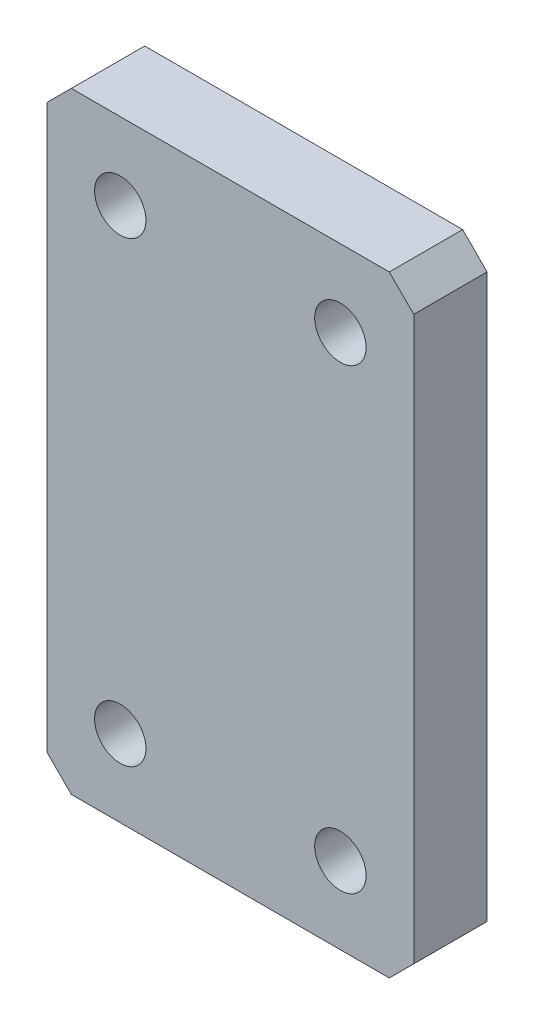
ISO-10303-21;
HEADER;
FILE_DESCRIPTION(('STEP AP214'),'2;1');
FILE_NAME('part.step','',(''),(''),'','','');
FILE_SCHEMA(('AUTOMOTIVE_DESIGN { 1 0 10303 214 1 1 1 1 }'));
ENDSEC;
DATA;
#1=APPLICATION_CONTEXT('core data for automotive mechanical design processes');
#2=APPLICATION_PROTOCOL_DEFINITION('international standard','automotive_design',2000,#1);
#3=PRODUCT_CONTEXT('',#1,'mechanical');
#4=PRODUCT('Part','Part','',(#3));
#5=PRODUCT_RELATED_PRODUCT_CATEGORY('part','',(#4));
#6=PRODUCT_DEFINITION_FORMATION('','',#4);
#7=PRODUCT_DEFINITION_CONTEXT('part definition',#1,'design');
#8=PRODUCT_DEFINITION('design','',#6,#7);
#9=PRODUCT_DEFINITION_SHAPE('','',#8);
#10=(LENGTH_UNIT() NAMED_UNIT(*) SI_UNIT(.MILLI.,.METRE.));
#11=(NAMED_UNIT(*) PLANE_ANGLE_UNIT() SI_UNIT($,.RADIAN.));
#12=(NAMED_UNIT(*) SI_UNIT($,.STERADIAN.) SOLID_ANGLE_UNIT());
#13=UNCERTAINTY_MEASURE_WITH_UNIT(LENGTH_MEASURE(1.E-05),#10,'distance_accuracy_value','');
#14=(GEOMETRIC_REPRESENTATION_CONTEXT(3) GLOBAL_UNCERTAINTY_ASSIGNED_CONTEXT((#13)) GLOBAL_UNIT_ASSIGNED_CONTEXT((#10,
#11,#12)) REPRESENTATION_CONTEXT('',''));
#15=CARTESIAN_POINT('',(0.,0.,0.));
#16=DIRECTION('',(0.,0.,1.));
#17=DIRECTION('',(1.,0.,0.));
#18=AXIS2_PLACEMENT_3D('',#15,#16,#17);
#19=CARTESIAN_POINT('',(0.,25.,6.));
#20=DIRECTION('',(1.,0.,0.));
#21=DIRECTION('',(0.,0.,-1.));
#22=AXIS2_PLACEMENT_3D('',#19,#20,#21);
#23=PLANE('',#22);
#24=DIRECTION('',(0.,-1.,0.));
#25=VECTOR('',#24,1.);
#26=CARTESIAN_POINT('',(0.,25.,0.));
#27=LINE('',#26,#25);
#28=CARTESIAN_POINT('',(0.,23.,0.));
#29=VERTEX_POINT('',#28);
#30=CARTESIAN_POINT('',(0.,-23.,0.));
#31=VERTEX_POINT('',#30);
#32=EDGE_CURVE('E136',#29,#31,#27,.T.);
#33=ORIENTED_EDGE('',*,*,#32,.T.);
#34=DIRECTION('',(0.,0.,1.));
#35=VECTOR('',#34,1.);
#36=CARTESIAN_POINT('',(0.,-23.,6.));
#37=LINE('',#36,#35);
#38=CARTESIAN_POINT('',(0.,-23.,6.));
#39=VERTEX_POINT('',#38);
#40=EDGE_CURVE('E114',#31,#39,#37,.T.);
#41=ORIENTED_EDGE('',*,*,#40,.T.);
#42=DIRECTION('',(0.,-1.,0.));
#43=VECTOR('',#42,1.);
#44=CARTESIAN_POINT('',(0.,25.,6.));
#45=LINE('',#44,#43);
#46=CARTESIAN_POINT('',(0.,23.,6.));
#47=VERTEX_POINT('',#46);
#48=EDGE_CURVE('E146',#47,#39,#45,.T.);
#49=ORIENTED_EDGE('',*,*,#48,.F.);
#50=DIRECTION('',(0.,0.,-1.));
#51=VECTOR('',#50,1.);
#52=CARTESIAN_POINT('',(0.,23.,6.));
#53=LINE('',#52,#51);
#54=EDGE_CURVE('E119',#47,#29,#53,.T.);
#55=ORIENTED_EDGE('',*,*,#54,.T.);
#56=EDGE_LOOP('',(#33,#41,#49,#55));
#57=FACE_BOUND('',#56,.T.);
#58=ADVANCED_FACE('F43',(#57),#23,.F.);
#59=CARTESIAN_POINT('',(0.,-25.,6.));
#60=DIRECTION('',(0.,1.,0.));
#61=DIRECTION('',(0.,0.,1.));
#62=AXIS2_PLACEMENT_3D('',#59,#60,#61);
#63=PLANE('',#62);
#64=DIRECTION('',(1.,0.,0.));
#65=VECTOR('',#64,1.);
#66=CARTESIAN_POINT('',(0.,-25.,6.));
#67=LINE('',#66,#65);
#68=CARTESIAN_POINT('',(2.00000000000001,-25.,6.));
#69=VERTEX_POINT('',#68);
#70=CARTESIAN_POINT('',(28.,-25.,6.));
#71=VERTEX_POINT('',#70);
#72=EDGE_CURVE('E129',#69,#71,#67,.T.);
#73=ORIENTED_EDGE('',*,*,#72,.F.);
#74=DIRECTION('',(0.,0.,-1.));
#75=VECTOR('',#74,1.);
#76=CARTESIAN_POINT('',(2.00000000000001,-25.,6.));
#77=LINE('',#76,#75);
#78=CARTESIAN_POINT('',(2.00000000000001,-25.,0.));
#79=VERTEX_POINT('',#78);
#80=EDGE_CURVE('E113',#69,#79,#77,.T.);
#81=ORIENTED_EDGE('',*,*,#80,.T.);
#82=DIRECTION('',(1.,0.,0.));
#83=VECTOR('',#82,1.);
#84=CARTESIAN_POINT('',(0.,-25.,0.));
#85=LINE('',#84,#83);
#86=CARTESIAN_POINT('',(28.,-25.,0.));
#87=VERTEX_POINT('',#86);
#88=EDGE_CURVE('E126',#79,#87,#85,.T.);
#89=ORIENTED_EDGE('',*,*,#88,.T.);
#90=DIRECTION('',(0.,0.,1.));
#91=VECTOR('',#90,1.);
#92=CARTESIAN_POINT('',(28.,-25.,6.));
#93=LINE('',#92,#91);
#94=EDGE_CURVE('E131',#87,#71,#93,.T.);
#95=ORIENTED_EDGE('',*,*,#94,.T.);
#96=EDGE_LOOP('',(#73,#81,#89,#95));
#97=FACE_BOUND('',#96,.T.);
#98=ADVANCED_FACE('F125',(#97),#63,.F.);
#99=CARTESIAN_POINT('',(30.,25.,6.));
#100=DIRECTION('',(-1.,0.,0.));
#101=DIRECTION('',(0.,0.,1.));
#102=AXIS2_PLACEMENT_3D('',#99,#100,#101);
#103=PLANE('',#102);
#104=DIRECTION('',(0.,1.,0.));
#105=VECTOR('',#104,1.);
#106=CARTESIAN_POINT('',(30.,25.,6.));
#107=LINE('',#106,#105);
#108=CARTESIAN_POINT('',(30.,-23.,6.));
#109=VERTEX_POINT('',#108);
#110=CARTESIAN_POINT('',(30.,23.,6.));
#111=VERTEX_POINT('',#110);
#112=EDGE_CURVE('E172',#109,#111,#107,.T.);
#113=ORIENTED_EDGE('',*,*,#112,.F.);
#114=DIRECTION('',(0.,0.,-1.));
#115=VECTOR('',#114,1.);
#116=CARTESIAN_POINT('',(30.,-23.,6.));
#117=LINE('',#116,#115);
#118=CARTESIAN_POINT('',(30.,-23.,0.));
#119=VERTEX_POINT('',#118);
#120=EDGE_CURVE('E165',#109,#119,#117,.T.);
#121=ORIENTED_EDGE('',*,*,#120,.T.);
#122=DIRECTION('',(0.,1.,0.));
#123=VECTOR('',#122,1.);
#124=CARTESIAN_POINT('',(30.,25.,0.));
#125=LINE('',#124,#123);
#126=CARTESIAN_POINT('',(30.,23.,0.));
#127=VERTEX_POINT('',#126);
#128=EDGE_CURVE('E135',#119,#127,#125,.T.);
#129=ORIENTED_EDGE('',*,*,#128,.T.);
#130=DIRECTION('',(0.,0.,1.));
#131=VECTOR('',#130,1.);
#132=CARTESIAN_POINT('',(30.,23.,6.));
#133=LINE('',#132,#131);
#134=EDGE_CURVE('E163',#127,#111,#133,.T.);
#135=ORIENTED_EDGE('',*,*,#134,.T.);
#136=EDGE_LOOP('',(#113,#121,#129,#135));
#137=FACE_BOUND('',#136,.T.);
#138=ADVANCED_FACE('F170',(#137),#103,.F.);
#139=CARTESIAN_POINT('',(0.,25.,6.));
#140=DIRECTION('',(0.,-1.,0.));
#141=DIRECTION('',(0.,0.,-1.));
#142=AXIS2_PLACEMENT_3D('',#139,#140,#141);
#143=PLANE('',#142);
#144=DIRECTION('',(-1.,0.,0.));
#145=VECTOR('',#144,1.);
#146=CARTESIAN_POINT('',(0.,25.,6.));
#147=LINE('',#146,#145);
#148=CARTESIAN_POINT('',(28.,25.,6.));
#149=VERTEX_POINT('',#148);
#150=CARTESIAN_POINT('',(2.00000000000003,25.,6.));
#151=VERTEX_POINT('',#150);
#152=EDGE_CURVE('E147',#149,#151,#147,.T.);
#153=ORIENTED_EDGE('',*,*,#152,.F.);
#154=DIRECTION('',(0.,0.,-1.));
#155=VECTOR('',#154,1.);
#156=CARTESIAN_POINT('',(28.,25.,6.));
#157=LINE('',#156,#155);
#158=CARTESIAN_POINT('',(28.,25.,0.));
#159=VERTEX_POINT('',#158);
#160=EDGE_CURVE('E11',#149,#159,#157,.T.);
#161=ORIENTED_EDGE('',*,*,#160,.T.);
#162=DIRECTION('',(-1.,0.,0.));
#163=VECTOR('',#162,1.);
#164=CARTESIAN_POINT('',(0.,25.,0.));
#165=LINE('',#164,#163);
#166=CARTESIAN_POINT('',(2.00000000000002,25.,0.));
#167=VERTEX_POINT('',#166);
#168=EDGE_CURVE('E139',#159,#167,#165,.T.);
#169=ORIENTED_EDGE('',*,*,#168,.T.);
#170=DIRECTION('',(0.,0.,1.));
#171=VECTOR('',#170,1.);
#172=CARTESIAN_POINT('',(2.00000000000002,25.,6.));
#173=LINE('',#172,#171);
#174=EDGE_CURVE('E51',#167,#151,#173,.T.);
#175=ORIENTED_EDGE('',*,*,#174,.T.);
#176=EDGE_LOOP('',(#153,#161,#169,#175));
#177=FACE_BOUND('',#176,.T.);
#178=ADVANCED_FACE('F179',(#177),#143,.F.);
#179=CARTESIAN_POINT('',(0.,-25.,6.));
#180=DIRECTION('',(0.,0.,1.));
#181=DIRECTION('',(1.,0.,0.));
#182=AXIS2_PLACEMENT_3D('',#179,#180,#181);
#183=PLANE('',#182);
#184=CARTESIAN_POINT('',(6.00000000000001,18.7,6.));
#185=DIRECTION('',(0.,0.,1.));
#186=DIRECTION('',(1.,0.,0.));
#187=AXIS2_PLACEMENT_3D('',#184,#185,#186);
#188=CIRCLE('',#187,2.09999999999999);
#189=CARTESIAN_POINT('',(8.09999999999999,18.7,6.));
#190=VERTEX_POINT('',#189);
#191=EDGE_CURVE('E206',#190,#190,#188,.T.);
#192=ORIENTED_EDGE('',*,*,#191,.F.);
#193=EDGE_LOOP('',(#192));
#194=FACE_BOUND('',#193,.T.);
#195=CARTESIAN_POINT('',(6.00000000000001,-18.7,6.));
#196=DIRECTION('',(0.,0.,1.));
#197=DIRECTION('',(1.,0.,0.));
#198=AXIS2_PLACEMENT_3D('',#195,#196,#197);
#199=CIRCLE('',#198,2.09999999999999);
#200=CARTESIAN_POINT('',(8.09999999999999,-18.7,6.));
#201=VERTEX_POINT('',#200);
#202=EDGE_CURVE('E200',#201,#201,#199,.T.);
#203=ORIENTED_EDGE('',*,*,#202,.F.);
#204=EDGE_LOOP('',(#203));
#205=FACE_BOUND('',#204,.T.);
#206=CARTESIAN_POINT('',(24.,-18.7,6.));
#207=DIRECTION('',(0.,0.,1.));
#208=DIRECTION('',(1.,0.,0.));
#209=AXIS2_PLACEMENT_3D('',#206,#207,#208);
#210=CIRCLE('',#209,2.09999999999999);
#211=CARTESIAN_POINT('',(26.1,-18.7,6.));
#212=VERTEX_POINT('',#211);
#213=EDGE_CURVE('E194',#212,#212,#210,.T.);
#214=ORIENTED_EDGE('',*,*,#213,.F.);
#215=EDGE_LOOP('',(#214));
#216=FACE_BOUND('',#215,.T.);
#217=CARTESIAN_POINT('',(24.,18.7,6.));
#218=DIRECTION('',(0.,0.,1.));
#219=DIRECTION('',(1.,0.,0.));
#220=AXIS2_PLACEMENT_3D('',#217,#218,#219);
#221=CIRCLE('',#220,2.09999999999999);
#222=CARTESIAN_POINT('',(26.1,18.7,6.));
#223=VERTEX_POINT('',#222);
#224=EDGE_CURVE('E188',#223,#223,#221,.T.);
#225=ORIENTED_EDGE('',*,*,#224,.F.);
#226=EDGE_LOOP('',(#225));
#227=FACE_BOUND('',#226,.T.);
#228=ORIENTED_EDGE('',*,*,#48,.T.);
#229=DIRECTION('',(-0.707106781186545,0.70710678118655,0.));
#230=VECTOR('',#229,1.);
#231=CARTESIAN_POINT('',(1.00000000000001,-24.,6.));
#232=LINE('',#231,#230);
#233=EDGE_CURVE('E161',#39,#69,#232,.F.);
#234=ORIENTED_EDGE('',*,*,#233,.T.);
#235=ORIENTED_EDGE('',*,*,#72,.T.);
#236=DIRECTION('',(-0.70710678118655,-0.707106781186545,0.));
#237=VECTOR('',#236,1.);
#238=CARTESIAN_POINT('',(13.9999999999999,-39.,6.));
#239=LINE('',#238,#237);
#240=EDGE_CURVE('E159',#71,#109,#239,.F.);
#241=ORIENTED_EDGE('',*,*,#240,.T.);
#242=ORIENTED_EDGE('',*,*,#112,.T.);
#243=DIRECTION('',(0.707106781186545,-0.70710678118655,0.));
#244=VECTOR('',#243,1.);
#245=CARTESIAN_POINT('',(39.0000000000001,13.9999999999998,6.));
#246=LINE('',#245,#244);
#247=EDGE_CURVE('E64',#111,#149,#246,.F.);
#248=ORIENTED_EDGE('',*,*,#247,.T.);
#249=ORIENTED_EDGE('',*,*,#152,.T.);
#250=DIRECTION('',(0.70710678118655,0.707106781186545,0.));
#251=VECTOR('',#250,1.);
#252=CARTESIAN_POINT('',(-24.,-0.999999999999834,6.));
#253=LINE('',#252,#251);
#254=EDGE_CURVE('E156',#151,#47,#253,.F.);
#255=ORIENTED_EDGE('',*,*,#254,.T.);
#256=EDGE_LOOP('',(#228,#234,#235,#241,#242,#248,#249,#255));
#257=FACE_BOUND('',#256,.T.);
#258=ADVANCED_FACE('F212',(#194,#205,#216,#227,#257),#183,.T.);
#259=CARTESIAN_POINT('',(0.,-25.,0.));
#260=DIRECTION('',(0.,0.,1.));
#261=DIRECTION('',(1.,0.,0.));
#262=AXIS2_PLACEMENT_3D('',#259,#260,#261);
#263=PLANE('',#262);
#264=CARTESIAN_POINT('',(6.00000000000001,18.7,0.));
#265=DIRECTION('',(0.,0.,1.));
#266=DIRECTION('',(1.,0.,0.));
#267=AXIS2_PLACEMENT_3D('',#264,#265,#266);
#268=CIRCLE('',#267,2.1);
#269=CARTESIAN_POINT('',(8.1,18.7,0.));
#270=VERTEX_POINT('',#269);
#271=EDGE_CURVE('E203',#270,#270,#268,.T.);
#272=ORIENTED_EDGE('',*,*,#271,.T.);
#273=EDGE_LOOP('',(#272));
#274=FACE_BOUND('',#273,.T.);
#275=CARTESIAN_POINT('',(6.00000000000001,-18.7,0.));
#276=DIRECTION('',(0.,0.,1.));
#277=DIRECTION('',(1.,0.,0.));
#278=AXIS2_PLACEMENT_3D('',#275,#276,#277);
#279=CIRCLE('',#278,2.1);
#280=CARTESIAN_POINT('',(8.1,-18.7,0.));
#281=VERTEX_POINT('',#280);
#282=EDGE_CURVE('E197',#281,#281,#279,.T.);
#283=ORIENTED_EDGE('',*,*,#282,.T.);
#284=EDGE_LOOP('',(#283));
#285=FACE_BOUND('',#284,.T.);
#286=CARTESIAN_POINT('',(24.,-18.7,0.));
#287=DIRECTION('',(0.,0.,1.));
#288=DIRECTION('',(1.,0.,0.));
#289=AXIS2_PLACEMENT_3D('',#286,#287,#288);
#290=CIRCLE('',#289,2.1);
#291=CARTESIAN_POINT('',(26.1,-18.7,0.));
#292=VERTEX_POINT('',#291);
#293=EDGE_CURVE('E191',#292,#292,#290,.T.);
#294=ORIENTED_EDGE('',*,*,#293,.T.);
#295=EDGE_LOOP('',(#294));
#296=FACE_BOUND('',#295,.T.);
#297=CARTESIAN_POINT('',(24.,18.7,0.));
#298=DIRECTION('',(0.,0.,1.));
#299=DIRECTION('',(1.,0.,0.));
#300=AXIS2_PLACEMENT_3D('',#297,#298,#299);
#301=CIRCLE('',#300,2.1);
#302=CARTESIAN_POINT('',(26.1,18.7,0.));
#303=VERTEX_POINT('',#302);
#304=EDGE_CURVE('E141',#303,#303,#301,.T.);
#305=ORIENTED_EDGE('',*,*,#304,.T.);
#306=EDGE_LOOP('',(#305));
#307=FACE_BOUND('',#306,.T.);
#308=ORIENTED_EDGE('',*,*,#88,.F.);
#309=DIRECTION('',(0.707106781186545,-0.70710678118655,0.));
#310=VECTOR('',#309,1.);
#311=CARTESIAN_POINT('',(2.00000000000001,-25.,0.));
#312=LINE('',#311,#310);
#313=EDGE_CURVE('E109',#79,#31,#312,.F.);
#314=ORIENTED_EDGE('',*,*,#313,.T.);
#315=ORIENTED_EDGE('',*,*,#32,.F.);
#316=DIRECTION('',(-0.70710678118655,-0.707106781186545,0.));
#317=VECTOR('',#316,1.);
#318=CARTESIAN_POINT('',(0.,23.,0.));
#319=LINE('',#318,#317);
#320=EDGE_CURVE('E130',#29,#167,#319,.F.);
#321=ORIENTED_EDGE('',*,*,#320,.T.);
#322=ORIENTED_EDGE('',*,*,#168,.F.);
#323=DIRECTION('',(-0.707106781186545,0.70710678118655,0.));
#324=VECTOR('',#323,1.);
#325=CARTESIAN_POINT('',(28.,25.,0.));
#326=LINE('',#325,#324);
#327=EDGE_CURVE('E150',#159,#127,#326,.F.);
#328=ORIENTED_EDGE('',*,*,#327,.T.);
#329=ORIENTED_EDGE('',*,*,#128,.F.);
#330=DIRECTION('',(0.70710678118655,0.707106781186545,0.));
#331=VECTOR('',#330,1.);
#332=CARTESIAN_POINT('',(30.,-23.,0.));
#333=LINE('',#332,#331);
#334=EDGE_CURVE('E120',#119,#87,#333,.F.);
#335=ORIENTED_EDGE('',*,*,#334,.T.);
#336=EDGE_LOOP('',(#308,#314,#315,#321,#322,#328,#329,#335));
#337=FACE_BOUND('',#336,.T.);
#338=ADVANCED_FACE('F133',(#274,#285,#296,#307,#337),#263,.F.);
#339=CARTESIAN_POINT('',(24.,18.7,6.));
#340=DIRECTION('',(0.,0.,1.));
#341=DIRECTION('',(1.,0.,0.));
#342=AXIS2_PLACEMENT_3D('',#339,#340,#341);
#343=CYLINDRICAL_SURFACE('',#342,2.09999999999999);
#344=ORIENTED_EDGE('',*,*,#304,.F.);
#345=EDGE_LOOP('',(#344));
#346=FACE_BOUND('',#345,.T.);
#347=ORIENTED_EDGE('',*,*,#224,.T.);
#348=EDGE_LOOP('',(#347));
#349=FACE_BOUND('',#348,.T.);
#350=ADVANCED_FACE('F260',(#346,#349),#343,.F.);
#351=CARTESIAN_POINT('',(24.,-18.7,6.));
#352=DIRECTION('',(0.,0.,1.));
#353=DIRECTION('',(1.,0.,0.));
#354=AXIS2_PLACEMENT_3D('',#351,#352,#353);
#355=CYLINDRICAL_SURFACE('',#354,2.09999999999999);
#356=ORIENTED_EDGE('',*,*,#293,.F.);
#357=EDGE_LOOP('',(#356));
#358=FACE_BOUND('',#357,.T.);
#359=ORIENTED_EDGE('',*,*,#213,.T.);
#360=EDGE_LOOP('',(#359));
#361=FACE_BOUND('',#360,.T.);
#362=ADVANCED_FACE('F290',(#358,#361),#355,.F.);
#363=CARTESIAN_POINT('',(6.00000000000001,-18.7,6.));
#364=DIRECTION('',(0.,0.,1.));
#365=DIRECTION('',(1.,0.,0.));
#366=AXIS2_PLACEMENT_3D('',#363,#364,#365);
#367=CYLINDRICAL_SURFACE('',#366,2.09999999999999);
#368=ORIENTED_EDGE('',*,*,#282,.F.);
#369=EDGE_LOOP('',(#368));
#370=FACE_BOUND('',#369,.T.);
#371=ORIENTED_EDGE('',*,*,#202,.T.);
#372=EDGE_LOOP('',(#371));
#373=FACE_BOUND('',#372,.T.);
#374=ADVANCED_FACE('F294',(#370,#373),#367,.F.);
#375=CARTESIAN_POINT('',(6.00000000000001,18.7,6.));
#376=DIRECTION('',(0.,0.,1.));
#377=DIRECTION('',(1.,0.,0.));
#378=AXIS2_PLACEMENT_3D('',#375,#376,#377);
#379=CYLINDRICAL_SURFACE('',#378,2.09999999999999);
#380=ORIENTED_EDGE('',*,*,#271,.F.);
#381=EDGE_LOOP('',(#380));
#382=FACE_BOUND('',#381,.T.);
#383=ORIENTED_EDGE('',*,*,#191,.T.);
#384=EDGE_LOOP('',(#383));
#385=FACE_BOUND('',#384,.T.);
#386=ADVANCED_FACE('F210',(#382,#385),#379,.F.);
#387=CARTESIAN_POINT('',(2.00000000000001,-25.,6.));
#388=DIRECTION('',(0.70710678118655,0.707106781186545,0.));
#389=DIRECTION('',(-0.707106781186545,0.70710678118655,0.));
#390=AXIS2_PLACEMENT_3D('',#387,#388,#389);
#391=PLANE('',#390);
#392=ORIENTED_EDGE('',*,*,#233,.F.);
#393=ORIENTED_EDGE('',*,*,#40,.F.);
#394=ORIENTED_EDGE('',*,*,#313,.F.);
#395=ORIENTED_EDGE('',*,*,#80,.F.);
#396=EDGE_LOOP('',(#392,#393,#394,#395));
#397=FACE_BOUND('',#396,.T.);
#398=ADVANCED_FACE('F112',(#397),#391,.F.);
#399=CARTESIAN_POINT('',(30.,-23.,6.));
#400=DIRECTION('',(-0.707106781186545,0.70710678118655,0.));
#401=DIRECTION('',(-0.70710678118655,-0.707106781186545,0.));
#402=AXIS2_PLACEMENT_3D('',#399,#400,#401);
#403=PLANE('',#402);
#404=ORIENTED_EDGE('',*,*,#240,.F.);
#405=ORIENTED_EDGE('',*,*,#94,.F.);
#406=ORIENTED_EDGE('',*,*,#334,.F.);
#407=ORIENTED_EDGE('',*,*,#120,.F.);
#408=EDGE_LOOP('',(#404,#405,#406,#407));
#409=FACE_BOUND('',#408,.T.);
#410=ADVANCED_FACE('F229',(#409),#403,.F.);
#411=CARTESIAN_POINT('',(28.,25.,6.));
#412=DIRECTION('',(-0.70710678118655,-0.707106781186545,0.));
#413=DIRECTION('',(0.707106781186545,-0.70710678118655,0.));
#414=AXIS2_PLACEMENT_3D('',#411,#412,#413);
#415=PLANE('',#414);
#416=ORIENTED_EDGE('',*,*,#247,.F.);
#417=ORIENTED_EDGE('',*,*,#134,.F.);
#418=ORIENTED_EDGE('',*,*,#327,.F.);
#419=ORIENTED_EDGE('',*,*,#160,.F.);
#420=EDGE_LOOP('',(#416,#417,#418,#419));
#421=FACE_BOUND('',#420,.T.);
#422=ADVANCED_FACE('F178',(#421),#415,.F.);
#423=CARTESIAN_POINT('',(0.,23.,6.));
#424=DIRECTION('',(0.707106781186545,-0.70710678118655,0.));
#425=DIRECTION('',(0.70710678118655,0.707106781186545,0.));
#426=AXIS2_PLACEMENT_3D('',#423,#424,#425);
#427=PLANE('',#426);
#428=ORIENTED_EDGE('',*,*,#254,.F.);
#429=ORIENTED_EDGE('',*,*,#174,.F.);
#430=ORIENTED_EDGE('',*,*,#320,.F.);
#431=ORIENTED_EDGE('',*,*,#54,.F.);
#432=EDGE_LOOP('',(#428,#429,#430,#431));
#433=FACE_BOUND('',#432,.T.);
#434=ADVANCED_FACE('F45',(#433),#427,.F.);
#435=CLOSED_SHELL('',(#58,#98,#138,#178,#258,#338,#350,#362,#374,#386,#398,#410,#422,#434));
#436=MANIFOLD_SOLID_BREP('B2',#435);
#437=ADVANCED_BREP_SHAPE_REPRESENTATION('',(#18,#436),#14);
#438=SHAPE_DEFINITION_REPRESENTATION(#9,#437);
ENDSEC;
END-ISO-10303-21;
